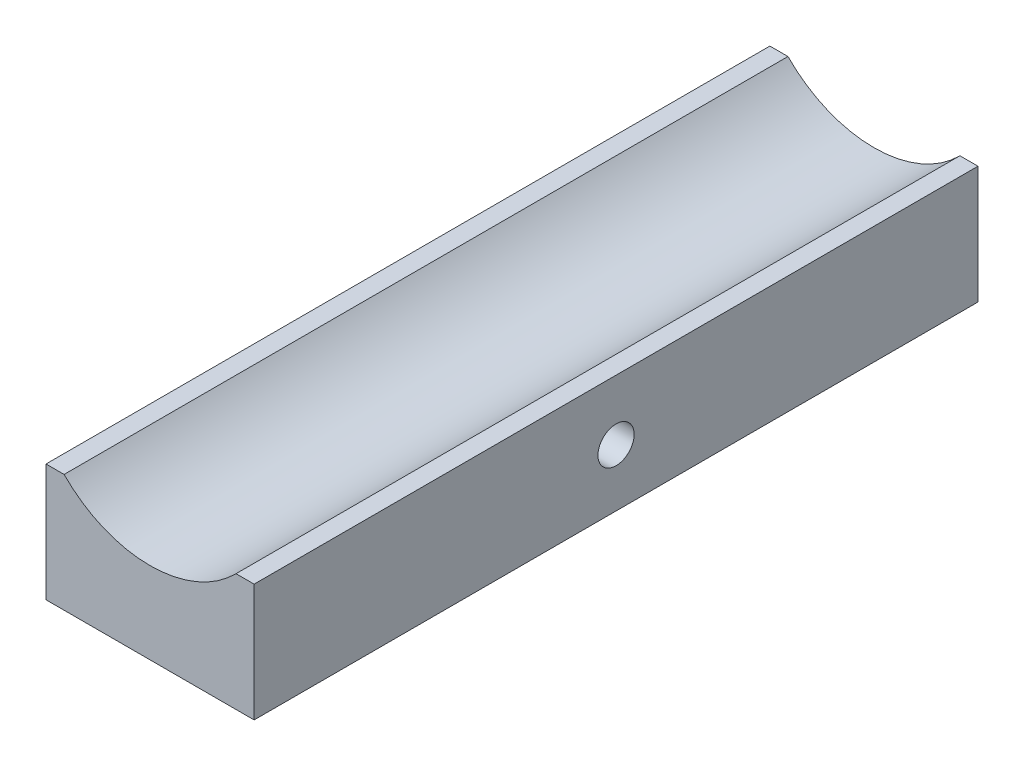
ISO-10303-21;
HEADER;
FILE_DESCRIPTION(('STEP AP214'),'2;1');
FILE_NAME('part.step','',(''),(''),'','','');
FILE_SCHEMA(('AUTOMOTIVE_DESIGN { 1 0 10303 214 1 1 1 1 }'));
ENDSEC;
DATA;
#1=APPLICATION_CONTEXT('core data for automotive mechanical design processes');
#2=APPLICATION_PROTOCOL_DEFINITION('international standard','automotive_design',2000,#1);
#3=PRODUCT_CONTEXT('',#1,'mechanical');
#4=PRODUCT('Part','Part','',(#3));
#5=PRODUCT_RELATED_PRODUCT_CATEGORY('part','',(#4));
#6=PRODUCT_DEFINITION_FORMATION('','',#4);
#7=PRODUCT_DEFINITION_CONTEXT('part definition',#1,'design');
#8=PRODUCT_DEFINITION('design','',#6,#7);
#9=PRODUCT_DEFINITION_SHAPE('','',#8);
#10=(LENGTH_UNIT() NAMED_UNIT(*) SI_UNIT(.MILLI.,.METRE.));
#11=(NAMED_UNIT(*) PLANE_ANGLE_UNIT() SI_UNIT($,.RADIAN.));
#12=(NAMED_UNIT(*) SI_UNIT($,.STERADIAN.) SOLID_ANGLE_UNIT());
#13=UNCERTAINTY_MEASURE_WITH_UNIT(LENGTH_MEASURE(1.E-05),#10,'distance_accuracy_value','');
#14=(GEOMETRIC_REPRESENTATION_CONTEXT(3) GLOBAL_UNCERTAINTY_ASSIGNED_CONTEXT((#13)) GLOBAL_UNIT_ASSIGNED_CONTEXT((#10,
#11,#12)) REPRESENTATION_CONTEXT('',''));
#15=CARTESIAN_POINT('',(0.,0.,0.));
#16=DIRECTION('',(0.,0.,1.));
#17=DIRECTION('',(1.,0.,0.));
#18=AXIS2_PLACEMENT_3D('',#15,#16,#17);
#19=CARTESIAN_POINT('',(-14.25,-5.,-60.));
#20=DIRECTION('',(0.,0.,-1.));
#21=DIRECTION('',(1.,0.,0.));
#22=AXIS2_PLACEMENT_3D('',#19,#20,#21);
#23=PLANE('',#22);
#24=CARTESIAN_POINT('',(0.,24.0334422006861,-60.));
#25=DIRECTION('',(0.,0.,-1.));
#26=DIRECTION('',(1.,0.,0.));
#27=AXIS2_PLACEMENT_3D('',#24,#25,#26);
#28=CIRCLE('',#27,19.9999999999999);
#29=CARTESIAN_POINT('',(14.25,10.,-60.));
#30=VERTEX_POINT('',#29);
#31=CARTESIAN_POINT('',(-14.25,10.,-60.));
#32=VERTEX_POINT('',#31);
#33=EDGE_CURVE('E107',#30,#32,#28,.T.);
#34=ORIENTED_EDGE('',*,*,#33,.F.);
#35=DIRECTION('',(-1.,0.,0.));
#36=VECTOR('',#35,1.);
#37=CARTESIAN_POINT('',(14.25,10.,-60.));
#38=LINE('',#37,#36);
#39=CARTESIAN_POINT('',(17.25,10.,-60.));
#40=VERTEX_POINT('',#39);
#41=EDGE_CURVE('E56',#40,#30,#38,.T.);
#42=ORIENTED_EDGE('',*,*,#41,.F.);
#43=DIRECTION('',(0.,1.,0.));
#44=VECTOR('',#43,1.);
#45=CARTESIAN_POINT('',(17.25,-9.5,-60.));
#46=LINE('',#45,#44);
#47=CARTESIAN_POINT('',(17.25,-9.5,-60.));
#48=VERTEX_POINT('',#47);
#49=EDGE_CURVE('E130',#48,#40,#46,.T.);
#50=ORIENTED_EDGE('',*,*,#49,.F.);
#51=DIRECTION('',(1.,0.,0.));
#52=VECTOR('',#51,1.);
#53=CARTESIAN_POINT('',(-14.25,-9.5,-60.));
#54=LINE('',#53,#52);
#55=CARTESIAN_POINT('',(-17.25,-9.5,-60.));
#56=VERTEX_POINT('',#55);
#57=EDGE_CURVE('E44',#56,#48,#54,.T.);
#58=ORIENTED_EDGE('',*,*,#57,.F.);
#59=DIRECTION('',(0.,1.,0.));
#60=VECTOR('',#59,1.);
#61=CARTESIAN_POINT('',(-17.25,-9.5,-60.));
#62=LINE('',#61,#60);
#63=CARTESIAN_POINT('',(-17.25,10.,-60.));
#64=VERTEX_POINT('',#63);
#65=EDGE_CURVE('E137',#56,#64,#62,.T.);
#66=ORIENTED_EDGE('',*,*,#65,.T.);
#67=DIRECTION('',(-1.,0.,0.));
#68=VECTOR('',#67,1.);
#69=CARTESIAN_POINT('',(-14.25,10.,-60.));
#70=LINE('',#69,#68);
#71=EDGE_CURVE('E79',#32,#64,#70,.T.);
#72=ORIENTED_EDGE('',*,*,#71,.F.);
#73=EDGE_LOOP('',(#34,#42,#50,#58,#66,#72));
#74=FACE_BOUND('',#73,.T.);
#75=ADVANCED_FACE('F41',(#74),#23,.T.);
#76=CARTESIAN_POINT('',(-14.25,-5.,60.));
#77=DIRECTION('',(0.,0.,-1.));
#78=DIRECTION('',(1.,0.,0.));
#79=AXIS2_PLACEMENT_3D('',#76,#77,#78);
#80=PLANE('',#79);
#81=DIRECTION('',(-1.,0.,0.));
#82=VECTOR('',#81,1.);
#83=CARTESIAN_POINT('',(14.25,10.,60.));
#84=LINE('',#83,#82);
#85=CARTESIAN_POINT('',(17.25,10.,60.));
#86=VERTEX_POINT('',#85);
#87=CARTESIAN_POINT('',(14.25,10.,60.));
#88=VERTEX_POINT('',#87);
#89=EDGE_CURVE('E113',#86,#88,#84,.T.);
#90=ORIENTED_EDGE('',*,*,#89,.T.);
#91=CARTESIAN_POINT('',(0.,24.0334422006861,60.));
#92=DIRECTION('',(0.,0.,-1.));
#93=DIRECTION('',(1.,0.,0.));
#94=AXIS2_PLACEMENT_3D('',#91,#92,#93);
#95=CIRCLE('',#94,19.9999999999999);
#96=CARTESIAN_POINT('',(-14.25,10.,60.));
#97=VERTEX_POINT('',#96);
#98=EDGE_CURVE('E98',#88,#97,#95,.T.);
#99=ORIENTED_EDGE('',*,*,#98,.T.);
#100=DIRECTION('',(-1.,0.,0.));
#101=VECTOR('',#100,1.);
#102=CARTESIAN_POINT('',(-14.25,10.,60.));
#103=LINE('',#102,#101);
#104=CARTESIAN_POINT('',(-17.25,10.,60.));
#105=VERTEX_POINT('',#104);
#106=EDGE_CURVE('E128',#97,#105,#103,.T.);
#107=ORIENTED_EDGE('',*,*,#106,.T.);
#108=DIRECTION('',(0.,1.,0.));
#109=VECTOR('',#108,1.);
#110=CARTESIAN_POINT('',(-17.25,-9.5,60.));
#111=LINE('',#110,#109);
#112=CARTESIAN_POINT('',(-17.25,-9.5,60.));
#113=VERTEX_POINT('',#112);
#114=EDGE_CURVE('E144',#113,#105,#111,.T.);
#115=ORIENTED_EDGE('',*,*,#114,.F.);
#116=DIRECTION('',(1.,0.,0.));
#117=VECTOR('',#116,1.);
#118=CARTESIAN_POINT('',(-14.25,-9.5,60.));
#119=LINE('',#118,#117);
#120=CARTESIAN_POINT('',(17.25,-9.5,60.));
#121=VERTEX_POINT('',#120);
#122=EDGE_CURVE('E11',#113,#121,#119,.T.);
#123=ORIENTED_EDGE('',*,*,#122,.T.);
#124=DIRECTION('',(0.,1.,0.));
#125=VECTOR('',#124,1.);
#126=CARTESIAN_POINT('',(17.25,-9.5,60.));
#127=LINE('',#126,#125);
#128=EDGE_CURVE('E115',#121,#86,#127,.T.);
#129=ORIENTED_EDGE('',*,*,#128,.T.);
#130=EDGE_LOOP('',(#90,#99,#107,#115,#123,#129));
#131=FACE_BOUND('',#130,.T.);
#132=ADVANCED_FACE('F114',(#131),#80,.F.);
#133=CARTESIAN_POINT('',(-14.25,-9.5,0.));
#134=DIRECTION('',(0.,-1.,0.));
#135=DIRECTION('',(0.,0.,-1.));
#136=AXIS2_PLACEMENT_3D('',#133,#134,#135);
#137=PLANE('',#136);
#138=ORIENTED_EDGE('',*,*,#122,.F.);
#139=DIRECTION('',(0.,0.,1.));
#140=VECTOR('',#139,1.);
#141=CARTESIAN_POINT('',(-17.25,-9.5,0.));
#142=LINE('',#141,#140);
#143=EDGE_CURVE('E142',#113,#56,#142,.F.);
#144=ORIENTED_EDGE('',*,*,#143,.T.);
#145=ORIENTED_EDGE('',*,*,#57,.T.);
#146=DIRECTION('',(0.,0.,1.));
#147=VECTOR('',#146,1.);
#148=CARTESIAN_POINT('',(17.25,-9.5,0.));
#149=LINE('',#148,#147);
#150=EDGE_CURVE('E124',#121,#48,#149,.F.);
#151=ORIENTED_EDGE('',*,*,#150,.F.);
#152=EDGE_LOOP('',(#138,#144,#145,#151));
#153=FACE_BOUND('',#152,.T.);
#154=ADVANCED_FACE('F146',(#153),#137,.T.);
#155=CARTESIAN_POINT('',(14.25,10.,0.));
#156=DIRECTION('',(0.,1.,0.));
#157=DIRECTION('',(0.,0.,-1.));
#158=AXIS2_PLACEMENT_3D('',#155,#156,#157);
#159=PLANE('',#158);
#160=ORIENTED_EDGE('',*,*,#89,.F.);
#161=DIRECTION('',(0.,0.,1.));
#162=VECTOR('',#161,1.);
#163=CARTESIAN_POINT('',(17.25,10.,0.));
#164=LINE('',#163,#162);
#165=EDGE_CURVE('E121',#86,#40,#164,.F.);
#166=ORIENTED_EDGE('',*,*,#165,.T.);
#167=ORIENTED_EDGE('',*,*,#41,.T.);
#168=DIRECTION('',(0.,0.,-1.));
#169=VECTOR('',#168,1.);
#170=CARTESIAN_POINT('',(14.25,10.,0.));
#171=LINE('',#170,#169);
#172=EDGE_CURVE('E105',#88,#30,#171,.T.);
#173=ORIENTED_EDGE('',*,*,#172,.F.);
#174=EDGE_LOOP('',(#160,#166,#167,#173));
#175=FACE_BOUND('',#174,.T.);
#176=ADVANCED_FACE('F120',(#175),#159,.T.);
#177=CARTESIAN_POINT('',(17.25,-9.5,0.));
#178=DIRECTION('',(-1.,0.,0.));
#179=DIRECTION('',(0.,0.,1.));
#180=AXIS2_PLACEMENT_3D('',#177,#178,#179);
#181=PLANE('',#180);
#182=CARTESIAN_POINT('',(17.25,0.,0.));
#183=DIRECTION('',(1.,0.,0.));
#184=DIRECTION('',(0.,0.,-1.));
#185=AXIS2_PLACEMENT_3D('',#182,#183,#184);
#186=CIRCLE('',#185,3.);
#187=CARTESIAN_POINT('',(17.25,0.,-3.));
#188=VERTEX_POINT('',#187);
#189=EDGE_CURVE('E244',#188,#188,#186,.T.);
#190=ORIENTED_EDGE('',*,*,#189,.F.);
#191=EDGE_LOOP('',(#190));
#192=FACE_BOUND('',#191,.T.);
#193=ORIENTED_EDGE('',*,*,#49,.T.);
#194=ORIENTED_EDGE('',*,*,#165,.F.);
#195=ORIENTED_EDGE('',*,*,#128,.F.);
#196=ORIENTED_EDGE('',*,*,#150,.T.);
#197=EDGE_LOOP('',(#193,#194,#195,#196));
#198=FACE_BOUND('',#197,.T.);
#199=ADVANCED_FACE('F135',(#192,#198),#181,.F.);
#200=CARTESIAN_POINT('',(-14.25,10.,0.));
#201=DIRECTION('',(0.,1.,0.));
#202=DIRECTION('',(0.,0.,-1.));
#203=AXIS2_PLACEMENT_3D('',#200,#201,#202);
#204=PLANE('',#203);
#205=ORIENTED_EDGE('',*,*,#106,.F.);
#206=DIRECTION('',(0.,0.,-1.));
#207=VECTOR('',#206,1.);
#208=CARTESIAN_POINT('',(-14.25,10.,0.));
#209=LINE('',#208,#207);
#210=EDGE_CURVE('E109',#97,#32,#209,.T.);
#211=ORIENTED_EDGE('',*,*,#210,.T.);
#212=ORIENTED_EDGE('',*,*,#71,.T.);
#213=DIRECTION('',(0.,0.,1.));
#214=VECTOR('',#213,1.);
#215=CARTESIAN_POINT('',(-17.25,10.,0.));
#216=LINE('',#215,#214);
#217=EDGE_CURVE('E143',#105,#64,#216,.F.);
#218=ORIENTED_EDGE('',*,*,#217,.F.);
#219=EDGE_LOOP('',(#205,#211,#212,#218));
#220=FACE_BOUND('',#219,.T.);
#221=ADVANCED_FACE('F151',(#220),#204,.T.);
#222=CARTESIAN_POINT('',(-17.25,-9.5,0.));
#223=DIRECTION('',(-1.,0.,0.));
#224=DIRECTION('',(0.,0.,1.));
#225=AXIS2_PLACEMENT_3D('',#222,#223,#224);
#226=PLANE('',#225);
#227=CARTESIAN_POINT('',(-17.25,0.,0.));
#228=DIRECTION('',(1.,0.,0.));
#229=DIRECTION('',(0.,0.,-1.));
#230=AXIS2_PLACEMENT_3D('',#227,#228,#229);
#231=CIRCLE('',#230,2.99999999999999);
#232=CARTESIAN_POINT('',(-17.25,0.,-2.99999999999999));
#233=VERTEX_POINT('',#232);
#234=EDGE_CURVE('E111',#233,#233,#231,.T.);
#235=ORIENTED_EDGE('',*,*,#234,.T.);
#236=EDGE_LOOP('',(#235));
#237=FACE_BOUND('',#236,.T.);
#238=ORIENTED_EDGE('',*,*,#65,.F.);
#239=ORIENTED_EDGE('',*,*,#143,.F.);
#240=ORIENTED_EDGE('',*,*,#114,.T.);
#241=ORIENTED_EDGE('',*,*,#217,.T.);
#242=EDGE_LOOP('',(#238,#239,#240,#241));
#243=FACE_BOUND('',#242,.T.);
#244=ADVANCED_FACE('F140',(#237,#243),#226,.T.);
#245=CARTESIAN_POINT('',(0.,24.0334422006861,-60.));
#246=DIRECTION('',(0.,0.,1.));
#247=DIRECTION('',(1.,0.,0.));
#248=AXIS2_PLACEMENT_3D('',#245,#246,#247);
#249=CYLINDRICAL_SURFACE('',#248,19.9999999999999);
#250=ORIENTED_EDGE('',*,*,#98,.F.);
#251=ORIENTED_EDGE('',*,*,#172,.T.);
#252=ORIENTED_EDGE('',*,*,#33,.T.);
#253=ORIENTED_EDGE('',*,*,#210,.F.);
#254=EDGE_LOOP('',(#250,#251,#252,#253));
#255=FACE_BOUND('',#254,.T.);
#256=ADVANCED_FACE('F108',(#255),#249,.F.);
#257=CARTESIAN_POINT('',(17.25,0.,0.));
#258=DIRECTION('',(1.,0.,0.));
#259=DIRECTION('',(0.,0.,-1.));
#260=AXIS2_PLACEMENT_3D('',#257,#258,#259);
#261=CYLINDRICAL_SURFACE('',#260,3.);
#262=ORIENTED_EDGE('',*,*,#234,.F.);
#263=EDGE_LOOP('',(#262));
#264=FACE_BOUND('',#263,.T.);
#265=ORIENTED_EDGE('',*,*,#189,.T.);
#266=EDGE_LOOP('',(#265));
#267=FACE_BOUND('',#266,.T.);
#268=ADVANCED_FACE('F225',(#264,#267),#261,.F.);
#269=CLOSED_SHELL('',(#75,#132,#154,#176,#199,#221,#244,#256,#268));
#270=MANIFOLD_SOLID_BREP('B2',#269);
#271=ADVANCED_BREP_SHAPE_REPRESENTATION('',(#18,#270),#14);
#272=SHAPE_DEFINITION_REPRESENTATION(#9,#271);
ENDSEC;
END-ISO-10303-21;
